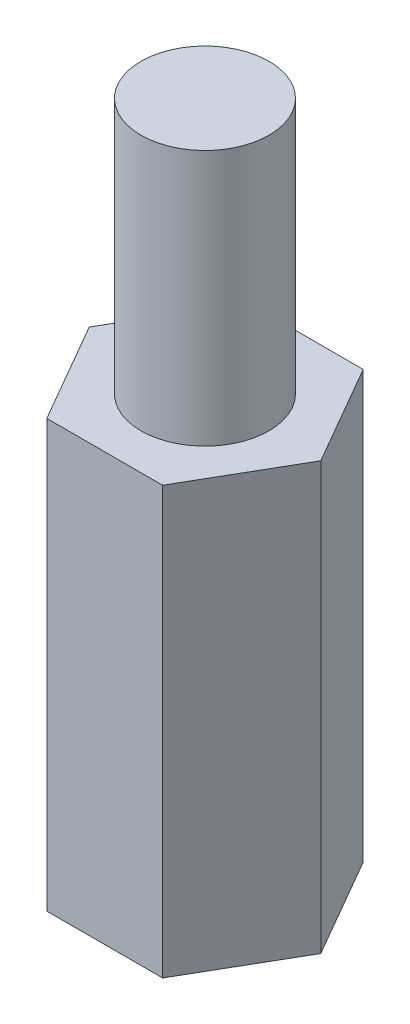
ISO-10303-21;
HEADER;
FILE_DESCRIPTION(('STEP AP214'),'2;1');
FILE_NAME('part.step','',(''),(''),'','','');
FILE_SCHEMA(('AUTOMOTIVE_DESIGN { 1 0 10303 214 1 1 1 1 }'));
ENDSEC;
DATA;
#1=APPLICATION_CONTEXT('core data for automotive mechanical design processes');
#2=APPLICATION_PROTOCOL_DEFINITION('international standard','automotive_design',2000,#1);
#3=PRODUCT_CONTEXT('',#1,'mechanical');
#4=PRODUCT('Part','Part','',(#3));
#5=PRODUCT_RELATED_PRODUCT_CATEGORY('part','',(#4));
#6=PRODUCT_DEFINITION_FORMATION('','',#4);
#7=PRODUCT_DEFINITION_CONTEXT('part definition',#1,'design');
#8=PRODUCT_DEFINITION('design','',#6,#7);
#9=PRODUCT_DEFINITION_SHAPE('','',#8);
#10=(LENGTH_UNIT() NAMED_UNIT(*) SI_UNIT(.MILLI.,.METRE.));
#11=(NAMED_UNIT(*) PLANE_ANGLE_UNIT() SI_UNIT($,.RADIAN.));
#12=(NAMED_UNIT(*) SI_UNIT($,.STERADIAN.) SOLID_ANGLE_UNIT());
#13=UNCERTAINTY_MEASURE_WITH_UNIT(LENGTH_MEASURE(1.E-05),#10,'distance_accuracy_value','');
#14=(GEOMETRIC_REPRESENTATION_CONTEXT(3) GLOBAL_UNCERTAINTY_ASSIGNED_CONTEXT((#13)) GLOBAL_UNIT_ASSIGNED_CONTEXT((#10,
#11,#12)) REPRESENTATION_CONTEXT('',''));
#15=CARTESIAN_POINT('',(0.,0.,0.));
#16=DIRECTION('',(0.,0.,1.));
#17=DIRECTION('',(1.,0.,0.));
#18=AXIS2_PLACEMENT_3D('',#15,#16,#17);
#19=CARTESIAN_POINT('',(0.,10.,0.));
#20=DIRECTION('',(0.,1.,0.));
#21=DIRECTION('',(0.,0.,1.));
#22=AXIS2_PLACEMENT_3D('',#19,#20,#21);
#23=PLANE('',#22);
#24=DIRECTION('',(0.5,0.,-0.866025403784439));
#25=VECTOR('',#24,1.);
#26=CARTESIAN_POINT('',(1.35677313259563,10.,2.35));
#27=LINE('',#26,#25);
#28=CARTESIAN_POINT('',(1.35677313259563,10.,2.35));
#29=VERTEX_POINT('',#28);
#30=CARTESIAN_POINT('',(2.71354626519124,10.,0.));
#31=VERTEX_POINT('',#30);
#32=EDGE_CURVE('E129',#29,#31,#27,.T.);
#33=ORIENTED_EDGE('',*,*,#32,.T.);
#34=DIRECTION('',(-0.500000000000001,0.,-0.866025403784438));
#35=VECTOR('',#34,1.);
#36=CARTESIAN_POINT('',(2.71354626519124,10.,0.));
#37=LINE('',#36,#35);
#38=CARTESIAN_POINT('',(1.35677313259561,10.,-2.35));
#39=VERTEX_POINT('',#38);
#40=EDGE_CURVE('E87',#31,#39,#37,.T.);
#41=ORIENTED_EDGE('',*,*,#40,.T.);
#42=DIRECTION('',(-1.,0.,0.));
#43=VECTOR('',#42,1.);
#44=CARTESIAN_POINT('',(1.35677313259561,10.,-2.35));
#45=LINE('',#44,#43);
#46=CARTESIAN_POINT('',(-1.35677313259562,10.,-2.35));
#47=VERTEX_POINT('',#46);
#48=EDGE_CURVE('E100',#39,#47,#45,.T.);
#49=ORIENTED_EDGE('',*,*,#48,.T.);
#50=DIRECTION('',(-0.5,0.,0.866025403784439));
#51=VECTOR('',#50,1.);
#52=CARTESIAN_POINT('',(-1.35677313259562,10.,-2.35));
#53=LINE('',#52,#51);
#54=CARTESIAN_POINT('',(-2.71354626519124,10.,0.));
#55=VERTEX_POINT('',#54);
#56=EDGE_CURVE('E94',#47,#55,#53,.T.);
#57=ORIENTED_EDGE('',*,*,#56,.T.);
#58=DIRECTION('',(0.5,0.,0.866025403784439));
#59=VECTOR('',#58,1.);
#60=CARTESIAN_POINT('',(-2.71354626519124,10.,0.));
#61=LINE('',#60,#59);
#62=CARTESIAN_POINT('',(-1.35677313259562,10.,2.35));
#63=VERTEX_POINT('',#62);
#64=EDGE_CURVE('E98',#55,#63,#61,.T.);
#65=ORIENTED_EDGE('',*,*,#64,.T.);
#66=DIRECTION('',(1.,0.,0.));
#67=VECTOR('',#66,1.);
#68=CARTESIAN_POINT('',(-1.35677313259562,10.,2.35));
#69=LINE('',#68,#67);
#70=EDGE_CURVE('E50',#63,#29,#69,.T.);
#71=ORIENTED_EDGE('',*,*,#70,.T.);
#72=EDGE_LOOP('',(#33,#41,#49,#57,#65,#71));
#73=FACE_BOUND('',#72,.T.);
#74=CARTESIAN_POINT('',(0.,10.,0.));
#75=DIRECTION('',(0.,1.,0.));
#76=DIRECTION('',(0.,0.,1.));
#77=AXIS2_PLACEMENT_3D('',#74,#75,#76);
#78=CIRCLE('',#77,1.5);
#79=CARTESIAN_POINT('',(0.,10.,1.5));
#80=VERTEX_POINT('',#79);
#81=EDGE_CURVE('E179',#80,#80,#78,.T.);
#82=ORIENTED_EDGE('',*,*,#81,.F.);
#83=EDGE_LOOP('',(#82));
#84=FACE_BOUND('',#83,.T.);
#85=ADVANCED_FACE('F33',(#73,#84),#23,.T.);
#86=CARTESIAN_POINT('',(1.35677313259563,10.,2.35));
#87=DIRECTION('',(-0.866025403784439,0.,-0.5));
#88=DIRECTION('',(-0.5,0.,0.866025403784439));
#89=AXIS2_PLACEMENT_3D('',#86,#87,#88);
#90=PLANE('',#89);
#91=DIRECTION('',(0.5,0.,-0.866025403784439));
#92=VECTOR('',#91,1.);
#93=CARTESIAN_POINT('',(1.35677313259563,0.,2.35));
#94=LINE('',#93,#92);
#95=CARTESIAN_POINT('',(1.35677313259563,0.,2.35));
#96=VERTEX_POINT('',#95);
#97=CARTESIAN_POINT('',(2.71354626519124,0.,0.));
#98=VERTEX_POINT('',#97);
#99=EDGE_CURVE('E118',#96,#98,#94,.T.);
#100=ORIENTED_EDGE('',*,*,#99,.T.);
#101=DIRECTION('',(0.,-1.,0.));
#102=VECTOR('',#101,1.);
#103=CARTESIAN_POINT('',(2.71354626519124,10.,0.));
#104=LINE('',#103,#102);
#105=EDGE_CURVE('E11',#31,#98,#104,.T.);
#106=ORIENTED_EDGE('',*,*,#105,.F.);
#107=ORIENTED_EDGE('',*,*,#32,.F.);
#108=DIRECTION('',(0.,-1.,0.));
#109=VECTOR('',#108,1.);
#110=CARTESIAN_POINT('',(1.35677313259563,10.,2.35));
#111=LINE('',#110,#109);
#112=EDGE_CURVE('E114',#29,#96,#111,.T.);
#113=ORIENTED_EDGE('',*,*,#112,.T.);
#114=EDGE_LOOP('',(#100,#106,#107,#113));
#115=FACE_BOUND('',#114,.T.);
#116=ADVANCED_FACE('F35',(#115),#90,.F.);
#117=CARTESIAN_POINT('',(2.71354626519124,10.,0.));
#118=DIRECTION('',(-0.866025403784438,0.,0.500000000000001));
#119=DIRECTION('',(0.500000000000001,0.,0.866025403784438));
#120=AXIS2_PLACEMENT_3D('',#117,#118,#119);
#121=PLANE('',#120);
#122=DIRECTION('',(-0.500000000000001,0.,-0.866025403784438));
#123=VECTOR('',#122,1.);
#124=CARTESIAN_POINT('',(2.71354626519124,0.,0.));
#125=LINE('',#124,#123);
#126=CARTESIAN_POINT('',(1.35677313259561,0.,-2.35));
#127=VERTEX_POINT('',#126);
#128=EDGE_CURVE('E121',#98,#127,#125,.T.);
#129=ORIENTED_EDGE('',*,*,#128,.T.);
#130=DIRECTION('',(0.,-1.,0.));
#131=VECTOR('',#130,1.);
#132=CARTESIAN_POINT('',(1.35677313259561,10.,-2.35));
#133=LINE('',#132,#131);
#134=EDGE_CURVE('E42',#39,#127,#133,.T.);
#135=ORIENTED_EDGE('',*,*,#134,.F.);
#136=ORIENTED_EDGE('',*,*,#40,.F.);
#137=ORIENTED_EDGE('',*,*,#105,.T.);
#138=EDGE_LOOP('',(#129,#135,#136,#137));
#139=FACE_BOUND('',#138,.T.);
#140=ADVANCED_FACE('F158',(#139),#121,.F.);
#141=CARTESIAN_POINT('',(1.35677313259561,10.,-2.35));
#142=DIRECTION('',(0.,0.,1.));
#143=DIRECTION('',(1.,0.,0.));
#144=AXIS2_PLACEMENT_3D('',#141,#142,#143);
#145=PLANE('',#144);
#146=DIRECTION('',(-1.,0.,0.));
#147=VECTOR('',#146,1.);
#148=CARTESIAN_POINT('',(1.35677313259561,0.,-2.35));
#149=LINE('',#148,#147);
#150=CARTESIAN_POINT('',(-1.35677313259562,0.,-2.35));
#151=VERTEX_POINT('',#150);
#152=EDGE_CURVE('E124',#127,#151,#149,.T.);
#153=ORIENTED_EDGE('',*,*,#152,.T.);
#154=DIRECTION('',(0.,-1.,0.));
#155=VECTOR('',#154,1.);
#156=CARTESIAN_POINT('',(-1.35677313259562,10.,-2.35));
#157=LINE('',#156,#155);
#158=EDGE_CURVE('E109',#47,#151,#157,.T.);
#159=ORIENTED_EDGE('',*,*,#158,.F.);
#160=ORIENTED_EDGE('',*,*,#48,.F.);
#161=ORIENTED_EDGE('',*,*,#134,.T.);
#162=EDGE_LOOP('',(#153,#159,#160,#161));
#163=FACE_BOUND('',#162,.T.);
#164=ADVANCED_FACE('F135',(#163),#145,.F.);
#165=CARTESIAN_POINT('',(-1.35677313259562,10.,-2.35));
#166=DIRECTION('',(0.866025403784439,0.,0.5));
#167=DIRECTION('',(0.5,0.,-0.866025403784439));
#168=AXIS2_PLACEMENT_3D('',#165,#166,#167);
#169=PLANE('',#168);
#170=DIRECTION('',(-0.5,0.,0.866025403784439));
#171=VECTOR('',#170,1.);
#172=CARTESIAN_POINT('',(-1.35677313259562,0.,-2.35));
#173=LINE('',#172,#171);
#174=CARTESIAN_POINT('',(-2.71354626519124,0.,0.));
#175=VERTEX_POINT('',#174);
#176=EDGE_CURVE('E108',#151,#175,#173,.T.);
#177=ORIENTED_EDGE('',*,*,#176,.T.);
#178=DIRECTION('',(0.,-1.,0.));
#179=VECTOR('',#178,1.);
#180=CARTESIAN_POINT('',(-2.71354626519124,10.,0.));
#181=LINE('',#180,#179);
#182=EDGE_CURVE('E105',#55,#175,#181,.T.);
#183=ORIENTED_EDGE('',*,*,#182,.F.);
#184=ORIENTED_EDGE('',*,*,#56,.F.);
#185=ORIENTED_EDGE('',*,*,#158,.T.);
#186=EDGE_LOOP('',(#177,#183,#184,#185));
#187=FACE_BOUND('',#186,.T.);
#188=ADVANCED_FACE('F106',(#187),#169,.F.);
#189=CARTESIAN_POINT('',(-2.71354626519124,10.,0.));
#190=DIRECTION('',(0.866025403784439,0.,-0.5));
#191=DIRECTION('',(-0.5,0.,-0.866025403784439));
#192=AXIS2_PLACEMENT_3D('',#189,#190,#191);
#193=PLANE('',#192);
#194=DIRECTION('',(0.5,0.,0.866025403784439));
#195=VECTOR('',#194,1.);
#196=CARTESIAN_POINT('',(-2.71354626519124,0.,0.));
#197=LINE('',#196,#195);
#198=CARTESIAN_POINT('',(-1.35677313259562,0.,2.35));
#199=VERTEX_POINT('',#198);
#200=EDGE_CURVE('E73',#175,#199,#197,.T.);
#201=ORIENTED_EDGE('',*,*,#200,.T.);
#202=DIRECTION('',(0.,-1.,0.));
#203=VECTOR('',#202,1.);
#204=CARTESIAN_POINT('',(-1.35677313259562,10.,2.35));
#205=LINE('',#204,#203);
#206=EDGE_CURVE('E110',#63,#199,#205,.T.);
#207=ORIENTED_EDGE('',*,*,#206,.F.);
#208=ORIENTED_EDGE('',*,*,#64,.F.);
#209=ORIENTED_EDGE('',*,*,#182,.T.);
#210=EDGE_LOOP('',(#201,#207,#208,#209));
#211=FACE_BOUND('',#210,.T.);
#212=ADVANCED_FACE('F112',(#211),#193,.F.);
#213=CARTESIAN_POINT('',(-1.35677313259562,10.,2.35));
#214=DIRECTION('',(0.,0.,-1.));
#215=DIRECTION('',(-1.,0.,0.));
#216=AXIS2_PLACEMENT_3D('',#213,#214,#215);
#217=PLANE('',#216);
#218=DIRECTION('',(1.,0.,0.));
#219=VECTOR('',#218,1.);
#220=CARTESIAN_POINT('',(-1.35677313259562,0.,2.35));
#221=LINE('',#220,#219);
#222=EDGE_CURVE('E79',#199,#96,#221,.T.);
#223=ORIENTED_EDGE('',*,*,#222,.T.);
#224=ORIENTED_EDGE('',*,*,#112,.F.);
#225=ORIENTED_EDGE('',*,*,#70,.F.);
#226=ORIENTED_EDGE('',*,*,#206,.T.);
#227=EDGE_LOOP('',(#223,#224,#225,#226));
#228=FACE_BOUND('',#227,.T.);
#229=ADVANCED_FACE('F142',(#228),#217,.F.);
#230=CARTESIAN_POINT('',(0.,0.,0.));
#231=DIRECTION('',(0.,1.,0.));
#232=DIRECTION('',(0.,0.,1.));
#233=AXIS2_PLACEMENT_3D('',#230,#231,#232);
#234=PLANE('',#233);
#235=CARTESIAN_POINT('',(0.,0.,0.));
#236=DIRECTION('',(0.,-1.,0.));
#237=DIRECTION('',(0.,0.,-1.));
#238=AXIS2_PLACEMENT_3D('',#235,#236,#237);
#239=CIRCLE('',#238,1.25);
#240=CARTESIAN_POINT('',(0.,0.,-1.25));
#241=VERTEX_POINT('',#240);
#242=EDGE_CURVE('E180',#241,#241,#239,.T.);
#243=ORIENTED_EDGE('',*,*,#242,.F.);
#244=EDGE_LOOP('',(#243));
#245=FACE_BOUND('',#244,.T.);
#246=ORIENTED_EDGE('',*,*,#99,.F.);
#247=ORIENTED_EDGE('',*,*,#222,.F.);
#248=ORIENTED_EDGE('',*,*,#200,.F.);
#249=ORIENTED_EDGE('',*,*,#176,.F.);
#250=ORIENTED_EDGE('',*,*,#152,.F.);
#251=ORIENTED_EDGE('',*,*,#128,.F.);
#252=EDGE_LOOP('',(#246,#247,#248,#249,#250,#251));
#253=FACE_BOUND('',#252,.T.);
#254=ADVANCED_FACE('F138',(#245,#253),#234,.F.);
#255=CARTESIAN_POINT('',(0.,16.,0.));
#256=DIRECTION('',(0.,-1.,0.));
#257=DIRECTION('',(0.,0.,-1.));
#258=AXIS2_PLACEMENT_3D('',#255,#256,#257);
#259=CYLINDRICAL_SURFACE('',#258,1.5);
#260=CARTESIAN_POINT('',(0.,16.,0.));
#261=DIRECTION('',(0.,1.,0.));
#262=DIRECTION('',(0.,0.,1.));
#263=AXIS2_PLACEMENT_3D('',#260,#261,#262);
#264=CIRCLE('',#263,1.5);
#265=CARTESIAN_POINT('',(0.,16.,1.5));
#266=VERTEX_POINT('',#265);
#267=EDGE_CURVE('E122',#266,#266,#264,.T.);
#268=ORIENTED_EDGE('',*,*,#267,.F.);
#269=EDGE_LOOP('',(#268));
#270=FACE_BOUND('',#269,.T.);
#271=ORIENTED_EDGE('',*,*,#81,.T.);
#272=EDGE_LOOP('',(#271));
#273=FACE_BOUND('',#272,.T.);
#274=ADVANCED_FACE('F149',(#270,#273),#259,.T.);
#275=CARTESIAN_POINT('',(0.,16.,0.));
#276=DIRECTION('',(0.,1.,0.));
#277=DIRECTION('',(0.,0.,1.));
#278=AXIS2_PLACEMENT_3D('',#275,#276,#277);
#279=PLANE('',#278);
#280=ORIENTED_EDGE('',*,*,#267,.T.);
#281=EDGE_LOOP('',(#280));
#282=FACE_BOUND('',#281,.T.);
#283=ADVANCED_FACE('F162',(#282),#279,.T.);
#284=CARTESIAN_POINT('',(0.,6.,0.));
#285=DIRECTION('',(0.,-1.,0.));
#286=DIRECTION('',(0.,0.,-1.));
#287=AXIS2_PLACEMENT_3D('',#284,#285,#286);
#288=CYLINDRICAL_SURFACE('',#287,1.25);
#289=CARTESIAN_POINT('',(0.,6.,0.));
#290=DIRECTION('',(0.,-1.,0.));
#291=DIRECTION('',(0.,0.,-1.));
#292=AXIS2_PLACEMENT_3D('',#289,#290,#291);
#293=CIRCLE('',#292,1.25);
#294=CARTESIAN_POINT('',(0.,6.,-1.25));
#295=VERTEX_POINT('',#294);
#296=EDGE_CURVE('E178',#295,#295,#293,.T.);
#297=ORIENTED_EDGE('',*,*,#296,.F.);
#298=EDGE_LOOP('',(#297));
#299=FACE_BOUND('',#298,.T.);
#300=ORIENTED_EDGE('',*,*,#242,.T.);
#301=EDGE_LOOP('',(#300));
#302=FACE_BOUND('',#301,.T.);
#303=ADVANCED_FACE('F166',(#299,#302),#288,.F.);
#304=CARTESIAN_POINT('',(0.,6.,0.));
#305=DIRECTION('',(0.,-1.,0.));
#306=DIRECTION('',(0.,0.,-1.));
#307=AXIS2_PLACEMENT_3D('',#304,#305,#306);
#308=PLANE('',#307);
#309=ORIENTED_EDGE('',*,*,#296,.T.);
#310=EDGE_LOOP('',(#309));
#311=FACE_BOUND('',#310,.T.);
#312=ADVANCED_FACE('F170',(#311),#308,.T.);
#313=CLOSED_SHELL('',(#85,#116,#140,#164,#188,#212,#229,#254,#274,#283,#303,#312));
#314=MANIFOLD_SOLID_BREP('B2',#313);
#315=ADVANCED_BREP_SHAPE_REPRESENTATION('',(#18,#314),#14);
#316=SHAPE_DEFINITION_REPRESENTATION(#9,#315);
ENDSEC;
END-ISO-10303-21;
